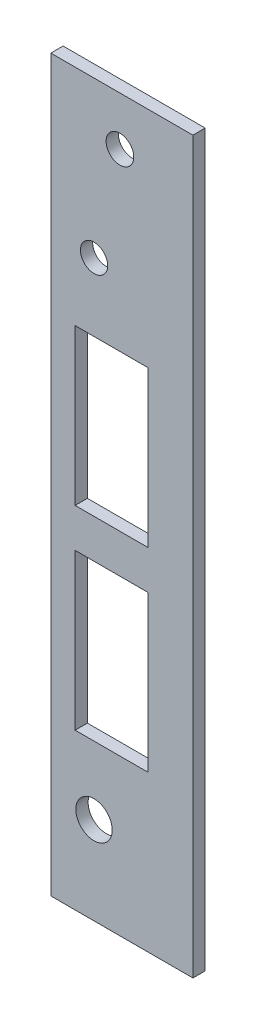
ISO-10303-21;
HEADER;
FILE_DESCRIPTION(('STEP AP214'),'2;1');
FILE_NAME('part.step','',(''),(''),'','','');
FILE_SCHEMA(('AUTOMOTIVE_DESIGN { 1 0 10303 214 1 1 1 1 }'));
ENDSEC;
DATA;
#1=APPLICATION_CONTEXT('core data for automotive mechanical design processes');
#2=APPLICATION_PROTOCOL_DEFINITION('international standard','automotive_design',2000,#1);
#3=PRODUCT_CONTEXT('',#1,'mechanical');
#4=PRODUCT('Part','Part','',(#3));
#5=PRODUCT_RELATED_PRODUCT_CATEGORY('part','',(#4));
#6=PRODUCT_DEFINITION_FORMATION('','',#4);
#7=PRODUCT_DEFINITION_CONTEXT('part definition',#1,'design');
#8=PRODUCT_DEFINITION('design','',#6,#7);
#9=PRODUCT_DEFINITION_SHAPE('','',#8);
#10=(LENGTH_UNIT() NAMED_UNIT(*) SI_UNIT(.MILLI.,.METRE.));
#11=(NAMED_UNIT(*) PLANE_ANGLE_UNIT() SI_UNIT($,.RADIAN.));
#12=(NAMED_UNIT(*) SI_UNIT($,.STERADIAN.) SOLID_ANGLE_UNIT());
#13=UNCERTAINTY_MEASURE_WITH_UNIT(LENGTH_MEASURE(1.E-05),#10,'distance_accuracy_value','');
#14=(GEOMETRIC_REPRESENTATION_CONTEXT(3) GLOBAL_UNCERTAINTY_ASSIGNED_CONTEXT((#13)) GLOBAL_UNIT_ASSIGNED_CONTEXT((#10,
#11,#12)) REPRESENTATION_CONTEXT('',''));
#15=CARTESIAN_POINT('',(0.,0.,0.));
#16=DIRECTION('',(0.,0.,1.));
#17=DIRECTION('',(1.,0.,0.));
#18=AXIS2_PLACEMENT_3D('',#15,#16,#17);
#19=CARTESIAN_POINT('',(0.,0.,1.6002));
#20=DIRECTION('',(1.,0.,0.));
#21=DIRECTION('',(0.,1.,0.));
#22=AXIS2_PLACEMENT_3D('',#19,#20,#21);
#23=PLANE('',#22);
#24=DIRECTION('',(0.,-1.,0.));
#25=VECTOR('',#24,1.);
#26=CARTESIAN_POINT('',(0.,0.,0.));
#27=LINE('',#26,#25);
#28=CARTESIAN_POINT('',(0.,0.,0.));
#29=VERTEX_POINT('',#28);
#30=CARTESIAN_POINT('',(0.,-95.25,0.));
#31=VERTEX_POINT('',#30);
#32=EDGE_CURVE('E181',#29,#31,#27,.T.);
#33=ORIENTED_EDGE('',*,*,#32,.T.);
#34=DIRECTION('',(0.,0.,-1.));
#35=VECTOR('',#34,1.);
#36=CARTESIAN_POINT('',(0.,-95.25,1.6002));
#37=LINE('',#36,#35);
#38=CARTESIAN_POINT('',(0.,-95.25,1.6002));
#39=VERTEX_POINT('',#38);
#40=EDGE_CURVE('E208',#39,#31,#37,.T.);
#41=ORIENTED_EDGE('',*,*,#40,.F.);
#42=DIRECTION('',(0.,-1.,0.));
#43=VECTOR('',#42,1.);
#44=CARTESIAN_POINT('',(0.,0.,1.6002));
#45=LINE('',#44,#43);
#46=CARTESIAN_POINT('',(0.,0.,1.6002));
#47=VERTEX_POINT('',#46);
#48=EDGE_CURVE('E190',#47,#39,#45,.T.);
#49=ORIENTED_EDGE('',*,*,#48,.F.);
#50=DIRECTION('',(0.,0.,-1.));
#51=VECTOR('',#50,1.);
#52=CARTESIAN_POINT('',(0.,0.,1.6002));
#53=LINE('',#52,#51);
#54=EDGE_CURVE('E199',#47,#29,#53,.T.);
#55=ORIENTED_EDGE('',*,*,#54,.T.);
#56=EDGE_LOOP('',(#33,#41,#49,#55));
#57=FACE_BOUND('',#56,.T.);
#58=ADVANCED_FACE('F31',(#57),#23,.F.);
#59=CARTESIAN_POINT('',(0.,-95.25,1.6002));
#60=DIRECTION('',(0.,1.,0.));
#61=DIRECTION('',(0.,0.,1.));
#62=AXIS2_PLACEMENT_3D('',#59,#60,#61);
#63=PLANE('',#62);
#64=DIRECTION('',(1.,0.,0.));
#65=VECTOR('',#64,1.);
#66=CARTESIAN_POINT('',(0.,-95.25,0.));
#67=LINE('',#66,#65);
#68=CARTESIAN_POINT('',(18.542,-95.25,0.));
#69=VERTEX_POINT('',#68);
#70=EDGE_CURVE('E184',#31,#69,#67,.T.);
#71=ORIENTED_EDGE('',*,*,#70,.T.);
#72=DIRECTION('',(0.,0.,-1.));
#73=VECTOR('',#72,1.);
#74=CARTESIAN_POINT('',(18.542,-95.25,1.6002));
#75=LINE('',#74,#73);
#76=CARTESIAN_POINT('',(18.542,-95.25,1.6002));
#77=VERTEX_POINT('',#76);
#78=EDGE_CURVE('E205',#77,#69,#75,.T.);
#79=ORIENTED_EDGE('',*,*,#78,.F.);
#80=DIRECTION('',(1.,0.,0.));
#81=VECTOR('',#80,1.);
#82=CARTESIAN_POINT('',(0.,-95.25,1.6002));
#83=LINE('',#82,#81);
#84=EDGE_CURVE('E193',#39,#77,#83,.T.);
#85=ORIENTED_EDGE('',*,*,#84,.F.);
#86=ORIENTED_EDGE('',*,*,#40,.T.);
#87=EDGE_LOOP('',(#71,#79,#85,#86));
#88=FACE_BOUND('',#87,.T.);
#89=ADVANCED_FACE('F251',(#88),#63,.F.);
#90=CARTESIAN_POINT('',(18.542,0.,1.6002));
#91=DIRECTION('',(-1.,0.,0.));
#92=DIRECTION('',(0.,-1.,0.));
#93=AXIS2_PLACEMENT_3D('',#90,#91,#92);
#94=PLANE('',#93);
#95=DIRECTION('',(0.,1.,0.));
#96=VECTOR('',#95,1.);
#97=CARTESIAN_POINT('',(18.542,0.,0.));
#98=LINE('',#97,#96);
#99=CARTESIAN_POINT('',(18.542,0.,0.));
#100=VERTEX_POINT('',#99);
#101=EDGE_CURVE('E186',#69,#100,#98,.T.);
#102=ORIENTED_EDGE('',*,*,#101,.T.);
#103=DIRECTION('',(0.,0.,-1.));
#104=VECTOR('',#103,1.);
#105=CARTESIAN_POINT('',(18.542,0.,1.6002));
#106=LINE('',#105,#104);
#107=CARTESIAN_POINT('',(18.542,0.,1.6002));
#108=VERTEX_POINT('',#107);
#109=EDGE_CURVE('E202',#108,#100,#106,.T.);
#110=ORIENTED_EDGE('',*,*,#109,.F.);
#111=DIRECTION('',(0.,1.,0.));
#112=VECTOR('',#111,1.);
#113=CARTESIAN_POINT('',(18.542,0.,1.6002));
#114=LINE('',#113,#112);
#115=EDGE_CURVE('E195',#77,#108,#114,.T.);
#116=ORIENTED_EDGE('',*,*,#115,.F.);
#117=ORIENTED_EDGE('',*,*,#78,.T.);
#118=EDGE_LOOP('',(#102,#110,#116,#117));
#119=FACE_BOUND('',#118,.T.);
#120=ADVANCED_FACE('F256',(#119),#94,.F.);
#121=CARTESIAN_POINT('',(0.,0.,1.6002));
#122=DIRECTION('',(0.,-1.,0.));
#123=DIRECTION('',(0.,0.,-1.));
#124=AXIS2_PLACEMENT_3D('',#121,#122,#123);
#125=PLANE('',#124);
#126=DIRECTION('',(-1.,0.,0.));
#127=VECTOR('',#126,1.);
#128=CARTESIAN_POINT('',(0.,0.,0.));
#129=LINE('',#128,#127);
#130=EDGE_CURVE('E188',#100,#29,#129,.T.);
#131=ORIENTED_EDGE('',*,*,#130,.T.);
#132=ORIENTED_EDGE('',*,*,#54,.F.);
#133=DIRECTION('',(-1.,0.,0.));
#134=VECTOR('',#133,1.);
#135=CARTESIAN_POINT('',(0.,0.,1.6002));
#136=LINE('',#135,#134);
#137=EDGE_CURVE('E197',#108,#47,#136,.T.);
#138=ORIENTED_EDGE('',*,*,#137,.F.);
#139=ORIENTED_EDGE('',*,*,#109,.T.);
#140=EDGE_LOOP('',(#131,#132,#138,#139));
#141=FACE_BOUND('',#140,.T.);
#142=ADVANCED_FACE('F271',(#141),#125,.F.);
#143=CARTESIAN_POINT('',(0.,-95.25,1.6002));
#144=DIRECTION('',(0.,0.,1.));
#145=DIRECTION('',(1.,0.,0.));
#146=AXIS2_PLACEMENT_3D('',#143,#144,#145);
#147=PLANE('',#146);
#148=DIRECTION('',(0.,-1.,0.));
#149=VECTOR('',#148,1.);
#150=CARTESIAN_POINT('',(3.175,-54.61,1.6002));
#151=LINE('',#150,#149);
#152=CARTESIAN_POINT('',(3.175,-54.61,1.6002));
#153=VERTEX_POINT('',#152);
#154=CARTESIAN_POINT('',(3.175,-74.93,1.6002));
#155=VERTEX_POINT('',#154);
#156=EDGE_CURVE('E45',#153,#155,#151,.T.);
#157=ORIENTED_EDGE('',*,*,#156,.F.);
#158=DIRECTION('',(-1.,0.,0.));
#159=VECTOR('',#158,1.);
#160=CARTESIAN_POINT('',(3.175,-54.61,1.6002));
#161=LINE('',#160,#159);
#162=CARTESIAN_POINT('',(12.7,-54.61,1.6002));
#163=VERTEX_POINT('',#162);
#164=EDGE_CURVE('E138',#163,#153,#161,.T.);
#165=ORIENTED_EDGE('',*,*,#164,.F.);
#166=DIRECTION('',(0.,1.,0.));
#167=VECTOR('',#166,1.);
#168=CARTESIAN_POINT('',(12.7,-54.61,1.6002));
#169=LINE('',#168,#167);
#170=CARTESIAN_POINT('',(12.7,-74.93,1.6002));
#171=VERTEX_POINT('',#170);
#172=EDGE_CURVE('E122',#171,#163,#169,.T.);
#173=ORIENTED_EDGE('',*,*,#172,.F.);
#174=DIRECTION('',(1.,0.,0.));
#175=VECTOR('',#174,1.);
#176=CARTESIAN_POINT('',(3.175,-74.93,1.6002));
#177=LINE('',#176,#175);
#178=EDGE_CURVE('E131',#155,#171,#177,.T.);
#179=ORIENTED_EDGE('',*,*,#178,.F.);
#180=EDGE_LOOP('',(#157,#165,#173,#179));
#181=FACE_BOUND('',#180,.T.);
#182=DIRECTION('',(0.,-1.,0.));
#183=VECTOR('',#182,1.);
#184=CARTESIAN_POINT('',(3.175,-29.21,1.6002));
#185=LINE('',#184,#183);
#186=CARTESIAN_POINT('',(3.175,-29.21,1.6002));
#187=VERTEX_POINT('',#186);
#188=CARTESIAN_POINT('',(3.175,-49.53,1.6002));
#189=VERTEX_POINT('',#188);
#190=EDGE_CURVE('E145',#187,#189,#185,.T.);
#191=ORIENTED_EDGE('',*,*,#190,.F.);
#192=DIRECTION('',(-1.,0.,0.));
#193=VECTOR('',#192,1.);
#194=CARTESIAN_POINT('',(3.175,-29.21,1.6002));
#195=LINE('',#194,#193);
#196=CARTESIAN_POINT('',(12.7,-29.21,1.6002));
#197=VERTEX_POINT('',#196);
#198=EDGE_CURVE('E155',#197,#187,#195,.T.);
#199=ORIENTED_EDGE('',*,*,#198,.F.);
#200=DIRECTION('',(0.,1.,0.));
#201=VECTOR('',#200,1.);
#202=CARTESIAN_POINT('',(12.7,-29.21,1.6002));
#203=LINE('',#202,#201);
#204=CARTESIAN_POINT('',(12.7,-49.53,1.6002));
#205=VERTEX_POINT('',#204);
#206=EDGE_CURVE('E152',#205,#197,#203,.T.);
#207=ORIENTED_EDGE('',*,*,#206,.F.);
#208=DIRECTION('',(1.,0.,0.));
#209=VECTOR('',#208,1.);
#210=CARTESIAN_POINT('',(3.175,-49.53,1.6002));
#211=LINE('',#210,#209);
#212=EDGE_CURVE('E149',#189,#205,#211,.T.);
#213=ORIENTED_EDGE('',*,*,#212,.F.);
#214=EDGE_LOOP('',(#191,#199,#207,#213));
#215=FACE_BOUND('',#214,.T.);
#216=CARTESIAN_POINT('',(5.63879999999999,-83.82,1.6002));
#217=DIRECTION('',(0.,0.,1.));
#218=DIRECTION('',(1.,0.,0.));
#219=AXIS2_PLACEMENT_3D('',#216,#217,#218);
#220=CIRCLE('',#219,2.3749);
#221=CARTESIAN_POINT('',(8.01369999999999,-83.82,1.6002));
#222=VERTEX_POINT('',#221);
#223=EDGE_CURVE('E161',#222,#222,#220,.T.);
#224=ORIENTED_EDGE('',*,*,#223,.F.);
#225=EDGE_LOOP('',(#224));
#226=FACE_BOUND('',#225,.T.);
#227=CARTESIAN_POINT('',(5.6388,-20.32,1.6002));
#228=DIRECTION('',(0.,0.,1.));
#229=DIRECTION('',(1.,0.,0.));
#230=AXIS2_PLACEMENT_3D('',#227,#228,#229);
#231=CIRCLE('',#230,1.778);
#232=CARTESIAN_POINT('',(7.4168,-20.32,1.6002));
#233=VERTEX_POINT('',#232);
#234=EDGE_CURVE('E171',#233,#233,#231,.T.);
#235=ORIENTED_EDGE('',*,*,#234,.F.);
#236=EDGE_LOOP('',(#235));
#237=FACE_BOUND('',#236,.T.);
#238=CARTESIAN_POINT('',(9.01700000000001,-6.34999999999999,1.6002));
#239=DIRECTION('',(0.,0.,1.));
#240=DIRECTION('',(1.,0.,0.));
#241=AXIS2_PLACEMENT_3D('',#238,#239,#240);
#242=CIRCLE('',#241,1.8034);
#243=CARTESIAN_POINT('',(10.8204,-6.34999999999999,1.6002));
#244=VERTEX_POINT('',#243);
#245=EDGE_CURVE('E175',#244,#244,#242,.T.);
#246=ORIENTED_EDGE('',*,*,#245,.F.);
#247=EDGE_LOOP('',(#246));
#248=FACE_BOUND('',#247,.T.);
#249=ORIENTED_EDGE('',*,*,#48,.T.);
#250=ORIENTED_EDGE('',*,*,#84,.T.);
#251=ORIENTED_EDGE('',*,*,#115,.T.);
#252=ORIENTED_EDGE('',*,*,#137,.T.);
#253=EDGE_LOOP('',(#249,#250,#251,#252));
#254=FACE_BOUND('',#253,.T.);
#255=ADVANCED_FACE('F135',(#181,#215,#226,#237,#248,#254),#147,.T.);
#256=CARTESIAN_POINT('',(0.,-95.25,0.));
#257=DIRECTION('',(0.,0.,1.));
#258=DIRECTION('',(1.,0.,0.));
#259=AXIS2_PLACEMENT_3D('',#256,#257,#258);
#260=PLANE('',#259);
#261=DIRECTION('',(-1.,0.,0.));
#262=VECTOR('',#261,1.);
#263=CARTESIAN_POINT('',(0.,-54.61,0.));
#264=LINE('',#263,#262);
#265=CARTESIAN_POINT('',(12.7,-54.61,0.));
#266=VERTEX_POINT('',#265);
#267=CARTESIAN_POINT('',(3.175,-54.61,0.));
#268=VERTEX_POINT('',#267);
#269=EDGE_CURVE('E38',#266,#268,#264,.T.);
#270=ORIENTED_EDGE('',*,*,#269,.T.);
#271=DIRECTION('',(0.,-1.,0.));
#272=VECTOR('',#271,1.);
#273=CARTESIAN_POINT('',(3.175,-95.25,0.));
#274=LINE('',#273,#272);
#275=CARTESIAN_POINT('',(3.175,-74.93,0.));
#276=VERTEX_POINT('',#275);
#277=EDGE_CURVE('E11',#268,#276,#274,.T.);
#278=ORIENTED_EDGE('',*,*,#277,.T.);
#279=DIRECTION('',(1.,0.,0.));
#280=VECTOR('',#279,1.);
#281=CARTESIAN_POINT('',(0.,-74.93,0.));
#282=LINE('',#281,#280);
#283=CARTESIAN_POINT('',(12.7,-74.93,0.));
#284=VERTEX_POINT('',#283);
#285=EDGE_CURVE('E227',#276,#284,#282,.T.);
#286=ORIENTED_EDGE('',*,*,#285,.T.);
#287=DIRECTION('',(0.,1.,0.));
#288=VECTOR('',#287,1.);
#289=CARTESIAN_POINT('',(12.7,-95.25,0.));
#290=LINE('',#289,#288);
#291=EDGE_CURVE('E125',#284,#266,#290,.T.);
#292=ORIENTED_EDGE('',*,*,#291,.T.);
#293=EDGE_LOOP('',(#270,#278,#286,#292));
#294=FACE_BOUND('',#293,.T.);
#295=DIRECTION('',(-1.,0.,0.));
#296=VECTOR('',#295,1.);
#297=CARTESIAN_POINT('',(0.,-29.21,0.));
#298=LINE('',#297,#296);
#299=CARTESIAN_POINT('',(12.7,-29.21,0.));
#300=VERTEX_POINT('',#299);
#301=CARTESIAN_POINT('',(3.175,-29.21,0.));
#302=VERTEX_POINT('',#301);
#303=EDGE_CURVE('E221',#300,#302,#298,.T.);
#304=ORIENTED_EDGE('',*,*,#303,.T.);
#305=DIRECTION('',(0.,-1.,0.));
#306=VECTOR('',#305,1.);
#307=CARTESIAN_POINT('',(3.17500000000001,-95.25,0.));
#308=LINE('',#307,#306);
#309=CARTESIAN_POINT('',(3.175,-49.53,0.));
#310=VERTEX_POINT('',#309);
#311=EDGE_CURVE('E224',#302,#310,#308,.T.);
#312=ORIENTED_EDGE('',*,*,#311,.T.);
#313=DIRECTION('',(1.,0.,0.));
#314=VECTOR('',#313,1.);
#315=CARTESIAN_POINT('',(0.,-49.53,0.));
#316=LINE('',#315,#314);
#317=CARTESIAN_POINT('',(12.7,-49.53,0.));
#318=VERTEX_POINT('',#317);
#319=EDGE_CURVE('E211',#310,#318,#316,.T.);
#320=ORIENTED_EDGE('',*,*,#319,.T.);
#321=DIRECTION('',(0.,1.,0.));
#322=VECTOR('',#321,1.);
#323=CARTESIAN_POINT('',(12.7,-95.25,0.));
#324=LINE('',#323,#322);
#325=EDGE_CURVE('E218',#318,#300,#324,.T.);
#326=ORIENTED_EDGE('',*,*,#325,.T.);
#327=EDGE_LOOP('',(#304,#312,#320,#326));
#328=FACE_BOUND('',#327,.T.);
#329=CARTESIAN_POINT('',(5.63879999999999,-83.82,0.));
#330=DIRECTION('',(0.,0.,1.));
#331=DIRECTION('',(1.,0.,0.));
#332=AXIS2_PLACEMENT_3D('',#329,#330,#331);
#333=CIRCLE('',#332,2.3749);
#334=CARTESIAN_POINT('',(8.01369999999999,-83.82,0.));
#335=VERTEX_POINT('',#334);
#336=EDGE_CURVE('E170',#335,#335,#333,.T.);
#337=ORIENTED_EDGE('',*,*,#336,.T.);
#338=EDGE_LOOP('',(#337));
#339=FACE_BOUND('',#338,.T.);
#340=CARTESIAN_POINT('',(5.6388,-20.32,0.));
#341=DIRECTION('',(0.,0.,1.));
#342=DIRECTION('',(1.,0.,0.));
#343=AXIS2_PLACEMENT_3D('',#340,#341,#342);
#344=CIRCLE('',#343,1.778);
#345=CARTESIAN_POINT('',(7.4168,-20.32,0.));
#346=VERTEX_POINT('',#345);
#347=EDGE_CURVE('E174',#346,#346,#344,.T.);
#348=ORIENTED_EDGE('',*,*,#347,.T.);
#349=EDGE_LOOP('',(#348));
#350=FACE_BOUND('',#349,.T.);
#351=CARTESIAN_POINT('',(9.01700000000001,-6.34999999999999,0.));
#352=DIRECTION('',(0.,0.,1.));
#353=DIRECTION('',(1.,0.,0.));
#354=AXIS2_PLACEMENT_3D('',#351,#352,#353);
#355=CIRCLE('',#354,1.8034);
#356=CARTESIAN_POINT('',(10.8204,-6.34999999999999,0.));
#357=VERTEX_POINT('',#356);
#358=EDGE_CURVE('E178',#357,#357,#355,.T.);
#359=ORIENTED_EDGE('',*,*,#358,.T.);
#360=EDGE_LOOP('',(#359));
#361=FACE_BOUND('',#360,.T.);
#362=ORIENTED_EDGE('',*,*,#32,.F.);
#363=ORIENTED_EDGE('',*,*,#130,.F.);
#364=ORIENTED_EDGE('',*,*,#101,.F.);
#365=ORIENTED_EDGE('',*,*,#70,.F.);
#366=EDGE_LOOP('',(#362,#363,#364,#365));
#367=FACE_BOUND('',#366,.T.);
#368=ADVANCED_FACE('F231',(#294,#328,#339,#350,#361,#367),#260,.F.);
#369=CARTESIAN_POINT('',(9.01700000000001,-6.34999999999999,0.));
#370=DIRECTION('',(0.,0.,1.));
#371=DIRECTION('',(1.,0.,0.));
#372=AXIS2_PLACEMENT_3D('',#369,#370,#371);
#373=CYLINDRICAL_SURFACE('',#372,1.8034);
#374=ORIENTED_EDGE('',*,*,#358,.F.);
#375=EDGE_LOOP('',(#374));
#376=FACE_BOUND('',#375,.T.);
#377=ORIENTED_EDGE('',*,*,#245,.T.);
#378=EDGE_LOOP('',(#377));
#379=FACE_BOUND('',#378,.T.);
#380=ADVANCED_FACE('F284',(#376,#379),#373,.F.);
#381=CARTESIAN_POINT('',(5.6388,-20.32,-0.9398));
#382=DIRECTION('',(0.,0.,1.));
#383=DIRECTION('',(1.,0.,0.));
#384=AXIS2_PLACEMENT_3D('',#381,#382,#383);
#385=CYLINDRICAL_SURFACE('',#384,1.778);
#386=ORIENTED_EDGE('',*,*,#234,.T.);
#387=EDGE_LOOP('',(#386));
#388=FACE_BOUND('',#387,.T.);
#389=ORIENTED_EDGE('',*,*,#347,.F.);
#390=EDGE_LOOP('',(#389));
#391=FACE_BOUND('',#390,.T.);
#392=ADVANCED_FACE('F287',(#388,#391),#385,.F.);
#393=CARTESIAN_POINT('',(5.63879999999999,-83.82,-0.9398));
#394=DIRECTION('',(0.,0.,1.));
#395=DIRECTION('',(1.,0.,0.));
#396=AXIS2_PLACEMENT_3D('',#393,#394,#395);
#397=CYLINDRICAL_SURFACE('',#396,2.3749);
#398=ORIENTED_EDGE('',*,*,#223,.T.);
#399=EDGE_LOOP('',(#398));
#400=FACE_BOUND('',#399,.T.);
#401=ORIENTED_EDGE('',*,*,#336,.F.);
#402=EDGE_LOOP('',(#401));
#403=FACE_BOUND('',#402,.T.);
#404=ADVANCED_FACE('F291',(#400,#403),#397,.F.);
#405=CARTESIAN_POINT('',(3.175,-29.21,-0.9398));
#406=DIRECTION('',(-1.,0.,0.));
#407=DIRECTION('',(0.,-1.,0.));
#408=AXIS2_PLACEMENT_3D('',#405,#406,#407);
#409=PLANE('',#408);
#410=DIRECTION('',(0.,0.,1.));
#411=VECTOR('',#410,1.);
#412=CARTESIAN_POINT('',(3.175,-29.21,-0.9398));
#413=LINE('',#412,#411);
#414=EDGE_CURVE('E159',#302,#187,#413,.T.);
#415=ORIENTED_EDGE('',*,*,#414,.T.);
#416=ORIENTED_EDGE('',*,*,#190,.T.);
#417=DIRECTION('',(0.,0.,1.));
#418=VECTOR('',#417,1.);
#419=CARTESIAN_POINT('',(3.175,-49.53,-0.9398));
#420=LINE('',#419,#418);
#421=EDGE_CURVE('E158',#310,#189,#420,.T.);
#422=ORIENTED_EDGE('',*,*,#421,.F.);
#423=ORIENTED_EDGE('',*,*,#311,.F.);
#424=EDGE_LOOP('',(#415,#416,#422,#423));
#425=FACE_BOUND('',#424,.T.);
#426=ADVANCED_FACE('F295',(#425),#409,.F.);
#427=CARTESIAN_POINT('',(3.175,-29.21,-0.9398));
#428=DIRECTION('',(0.,1.,0.));
#429=DIRECTION('',(0.,0.,1.));
#430=AXIS2_PLACEMENT_3D('',#427,#428,#429);
#431=PLANE('',#430);
#432=DIRECTION('',(0.,0.,1.));
#433=VECTOR('',#432,1.);
#434=CARTESIAN_POINT('',(12.7,-29.21,-0.9398));
#435=LINE('',#434,#433);
#436=EDGE_CURVE('E162',#300,#197,#435,.T.);
#437=ORIENTED_EDGE('',*,*,#436,.T.);
#438=ORIENTED_EDGE('',*,*,#198,.T.);
#439=ORIENTED_EDGE('',*,*,#414,.F.);
#440=ORIENTED_EDGE('',*,*,#303,.F.);
#441=EDGE_LOOP('',(#437,#438,#439,#440));
#442=FACE_BOUND('',#441,.T.);
#443=ADVANCED_FACE('F298',(#442),#431,.F.);
#444=CARTESIAN_POINT('',(12.7,-29.21,-0.9398));
#445=DIRECTION('',(1.,0.,0.));
#446=DIRECTION('',(0.,1.,0.));
#447=AXIS2_PLACEMENT_3D('',#444,#445,#446);
#448=PLANE('',#447);
#449=DIRECTION('',(0.,0.,1.));
#450=VECTOR('',#449,1.);
#451=CARTESIAN_POINT('',(12.7,-49.53,-0.9398));
#452=LINE('',#451,#450);
#453=EDGE_CURVE('E164',#318,#205,#452,.T.);
#454=ORIENTED_EDGE('',*,*,#453,.T.);
#455=ORIENTED_EDGE('',*,*,#206,.T.);
#456=ORIENTED_EDGE('',*,*,#436,.F.);
#457=ORIENTED_EDGE('',*,*,#325,.F.);
#458=EDGE_LOOP('',(#454,#455,#456,#457));
#459=FACE_BOUND('',#458,.T.);
#460=ADVANCED_FACE('F245',(#459),#448,.F.);
#461=CARTESIAN_POINT('',(3.175,-49.53,-0.9398));
#462=DIRECTION('',(0.,-1.,0.));
#463=DIRECTION('',(0.,0.,-1.));
#464=AXIS2_PLACEMENT_3D('',#461,#462,#463);
#465=PLANE('',#464);
#466=ORIENTED_EDGE('',*,*,#421,.T.);
#467=ORIENTED_EDGE('',*,*,#212,.T.);
#468=ORIENTED_EDGE('',*,*,#453,.F.);
#469=ORIENTED_EDGE('',*,*,#319,.F.);
#470=EDGE_LOOP('',(#466,#467,#468,#469));
#471=FACE_BOUND('',#470,.T.);
#472=ADVANCED_FACE('F238',(#471),#465,.F.);
#473=CARTESIAN_POINT('',(3.175,-54.61,-0.9398));
#474=DIRECTION('',(-1.,0.,0.));
#475=DIRECTION('',(0.,-1.,0.));
#476=AXIS2_PLACEMENT_3D('',#473,#474,#475);
#477=PLANE('',#476);
#478=DIRECTION('',(0.,0.,1.));
#479=VECTOR('',#478,1.);
#480=CARTESIAN_POINT('',(3.175,-54.61,-0.9398));
#481=LINE('',#480,#479);
#482=EDGE_CURVE('E143',#268,#153,#481,.T.);
#483=ORIENTED_EDGE('',*,*,#482,.T.);
#484=ORIENTED_EDGE('',*,*,#156,.T.);
#485=DIRECTION('',(0.,0.,1.));
#486=VECTOR('',#485,1.);
#487=CARTESIAN_POINT('',(3.175,-74.93,-0.9398));
#488=LINE('',#487,#486);
#489=EDGE_CURVE('E128',#276,#155,#488,.T.);
#490=ORIENTED_EDGE('',*,*,#489,.F.);
#491=ORIENTED_EDGE('',*,*,#277,.F.);
#492=EDGE_LOOP('',(#483,#484,#490,#491));
#493=FACE_BOUND('',#492,.T.);
#494=ADVANCED_FACE('F236',(#493),#477,.F.);
#495=CARTESIAN_POINT('',(3.175,-54.61,-0.9398));
#496=DIRECTION('',(0.,1.,0.));
#497=DIRECTION('',(0.,0.,1.));
#498=AXIS2_PLACEMENT_3D('',#495,#496,#497);
#499=PLANE('',#498);
#500=DIRECTION('',(0.,0.,1.));
#501=VECTOR('',#500,1.);
#502=CARTESIAN_POINT('',(12.7,-54.61,-0.9398));
#503=LINE('',#502,#501);
#504=EDGE_CURVE('E127',#266,#163,#503,.T.);
#505=ORIENTED_EDGE('',*,*,#504,.T.);
#506=ORIENTED_EDGE('',*,*,#164,.T.);
#507=ORIENTED_EDGE('',*,*,#482,.F.);
#508=ORIENTED_EDGE('',*,*,#269,.F.);
#509=EDGE_LOOP('',(#505,#506,#507,#508));
#510=FACE_BOUND('',#509,.T.);
#511=ADVANCED_FACE('F235',(#510),#499,.F.);
#512=CARTESIAN_POINT('',(12.7,-54.61,-0.9398));
#513=DIRECTION('',(1.,0.,0.));
#514=DIRECTION('',(0.,0.,-1.));
#515=AXIS2_PLACEMENT_3D('',#512,#513,#514);
#516=PLANE('',#515);
#517=DIRECTION('',(0.,0.,1.));
#518=VECTOR('',#517,1.);
#519=CARTESIAN_POINT('',(12.7,-74.93,-0.9398));
#520=LINE('',#519,#518);
#521=EDGE_CURVE('E53',#284,#171,#520,.T.);
#522=ORIENTED_EDGE('',*,*,#521,.T.);
#523=ORIENTED_EDGE('',*,*,#172,.T.);
#524=ORIENTED_EDGE('',*,*,#504,.F.);
#525=ORIENTED_EDGE('',*,*,#291,.F.);
#526=EDGE_LOOP('',(#522,#523,#524,#525));
#527=FACE_BOUND('',#526,.T.);
#528=ADVANCED_FACE('F119',(#527),#516,.F.);
#529=CARTESIAN_POINT('',(3.175,-74.93,-0.9398));
#530=DIRECTION('',(0.,-1.,0.));
#531=DIRECTION('',(0.,0.,-1.));
#532=AXIS2_PLACEMENT_3D('',#529,#530,#531);
#533=PLANE('',#532);
#534=ORIENTED_EDGE('',*,*,#489,.T.);
#535=ORIENTED_EDGE('',*,*,#178,.T.);
#536=ORIENTED_EDGE('',*,*,#521,.F.);
#537=ORIENTED_EDGE('',*,*,#285,.F.);
#538=EDGE_LOOP('',(#534,#535,#536,#537));
#539=FACE_BOUND('',#538,.T.);
#540=ADVANCED_FACE('F132',(#539),#533,.F.);
#541=CLOSED_SHELL('',(#58,#89,#120,#142,#255,#368,#380,#392,#404,#426,#443,#460,#472,#494,#511,
#528,#540));
#542=MANIFOLD_SOLID_BREP('B2',#541);
#543=ADVANCED_BREP_SHAPE_REPRESENTATION('',(#18,#542),#14);
#544=SHAPE_DEFINITION_REPRESENTATION(#9,#543);
ENDSEC;
END-ISO-10303-21;
